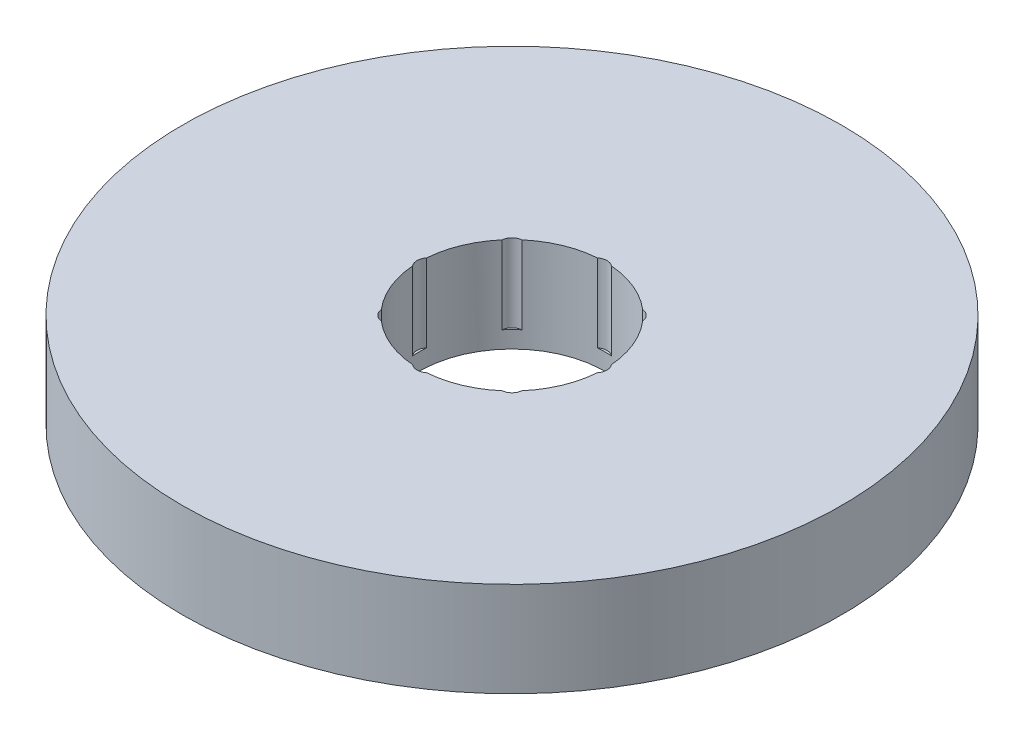
ISO-10303-21;
HEADER;
FILE_DESCRIPTION(('STEP AP214'),'2;1');
FILE_NAME('part.step','',(''),(''),'','','');
FILE_SCHEMA(('AUTOMOTIVE_DESIGN { 1 0 10303 214 1 1 1 1 }'));
ENDSEC;
DATA;
#1=APPLICATION_CONTEXT('core data for automotive mechanical design processes');
#2=APPLICATION_PROTOCOL_DEFINITION('international standard','automotive_design',2000,#1);
#3=PRODUCT_CONTEXT('',#1,'mechanical');
#4=PRODUCT('Part','Part','',(#3));
#5=PRODUCT_RELATED_PRODUCT_CATEGORY('part','',(#4));
#6=PRODUCT_DEFINITION_FORMATION('','',#4);
#7=PRODUCT_DEFINITION_CONTEXT('part definition',#1,'design');
#8=PRODUCT_DEFINITION('design','',#6,#7);
#9=PRODUCT_DEFINITION_SHAPE('','',#8);
#10=(LENGTH_UNIT() NAMED_UNIT(*) SI_UNIT(.MILLI.,.METRE.));
#11=(NAMED_UNIT(*) PLANE_ANGLE_UNIT() SI_UNIT($,.RADIAN.));
#12=(NAMED_UNIT(*) SI_UNIT($,.STERADIAN.) SOLID_ANGLE_UNIT());
#13=UNCERTAINTY_MEASURE_WITH_UNIT(LENGTH_MEASURE(1.E-05),#10,'distance_accuracy_value','');
#14=(GEOMETRIC_REPRESENTATION_CONTEXT(3) GLOBAL_UNCERTAINTY_ASSIGNED_CONTEXT((#13)) GLOBAL_UNIT_ASSIGNED_CONTEXT((#10,
#11,#12)) REPRESENTATION_CONTEXT('',''));
#15=CARTESIAN_POINT('',(0.,0.,0.));
#16=DIRECTION('',(0.,0.,1.));
#17=DIRECTION('',(1.,0.,0.));
#18=AXIS2_PLACEMENT_3D('',#15,#16,#17);
#19=CARTESIAN_POINT('',(0.,23.,0.));
#20=DIRECTION('',(0.,-1.,0.));
#21=DIRECTION('',(0.,0.,-1.));
#22=AXIS2_PLACEMENT_3D('',#19,#20,#21);
#23=CYLINDRICAL_SURFACE('',#22,80.);
#24=CARTESIAN_POINT('',(0.,23.,0.));
#25=DIRECTION('',(0.,1.,0.));
#26=DIRECTION('',(0.,0.,1.));
#27=AXIS2_PLACEMENT_3D('',#24,#25,#26);
#28=CIRCLE('',#27,80.);
#29=CARTESIAN_POINT('',(0.,23.,80.));
#30=VERTEX_POINT('',#29);
#31=EDGE_CURVE('E183',#30,#30,#28,.T.);
#32=ORIENTED_EDGE('',*,*,#31,.F.);
#33=EDGE_LOOP('',(#32));
#34=FACE_BOUND('',#33,.T.);
#35=CARTESIAN_POINT('',(0.,0.,0.));
#36=DIRECTION('',(0.,1.,0.));
#37=DIRECTION('',(0.,0.,1.));
#38=AXIS2_PLACEMENT_3D('',#35,#36,#37);
#39=CIRCLE('',#38,80.);
#40=CARTESIAN_POINT('',(0.,0.,80.));
#41=VERTEX_POINT('',#40);
#42=EDGE_CURVE('E182',#41,#41,#39,.T.);
#43=ORIENTED_EDGE('',*,*,#42,.T.);
#44=EDGE_LOOP('',(#43));
#45=FACE_BOUND('',#44,.T.);
#46=ADVANCED_FACE('F39',(#34,#45),#23,.T.);
#47=CARTESIAN_POINT('',(0.,23.,0.));
#48=DIRECTION('',(0.,1.,0.));
#49=DIRECTION('',(0.,0.,1.));
#50=AXIS2_PLACEMENT_3D('',#47,#48,#49);
#51=PLANE('',#50);
#52=CARTESIAN_POINT('',(0.,23.,20.3535945266166));
#53=DIRECTION('',(0.,1.,0.));
#54=DIRECTION('',(1.,0.,0.));
#55=AXIS2_PLACEMENT_3D('',#52,#53,#54);
#56=CIRCLE('',#55,2.68549616767782);
#57=CARTESIAN_POINT('',(-1.69571030406203,23.,22.43601048682));
#58=VERTEX_POINT('',#57);
#59=CARTESIAN_POINT('',(1.69571030406219,23.,22.43601048682));
#60=VERTEX_POINT('',#59);
#61=EDGE_CURVE('E256',#58,#60,#56,.T.);
#62=ORIENTED_EDGE('',*,*,#61,.F.);
#63=CARTESIAN_POINT('',(0.,23.,0.));
#64=DIRECTION('',(0.,1.,0.));
#65=DIRECTION('',(0.,0.,1.));
#66=AXIS2_PLACEMENT_3D('',#63,#64,#65);
#67=CIRCLE('',#66,22.5);
#68=CARTESIAN_POINT('',(-14.6656069030727,23.,17.0637034129332));
#69=VERTEX_POINT('',#68);
#70=EDGE_CURVE('E175',#69,#58,#67,.T.);
#71=ORIENTED_EDGE('',*,*,#70,.F.);
#72=CARTESIAN_POINT('',(-14.392164711292,23.,14.392164711292));
#73=DIRECTION('',(0.,1.,0.));
#74=DIRECTION('',(0.707106781186549,0.,0.707106781186546));
#75=AXIS2_PLACEMENT_3D('',#72,#73,#74);
#76=CIRCLE('',#75,2.68549616767782);
#77=CARTESIAN_POINT('',(-17.0637034129331,23.,14.6656069030727));
#78=VERTEX_POINT('',#77);
#79=EDGE_CURVE('E152',#78,#69,#76,.T.);
#80=ORIENTED_EDGE('',*,*,#79,.F.);
#81=CARTESIAN_POINT('',(-22.43601048682,23.,1.69571030406211));
#82=VERTEX_POINT('',#81);
#83=EDGE_CURVE('E168',#82,#78,#67,.T.);
#84=ORIENTED_EDGE('',*,*,#83,.F.);
#85=CARTESIAN_POINT('',(-20.3535945266166,23.,0.));
#86=DIRECTION('',(0.,1.,0.));
#87=DIRECTION('',(0.,0.,1.));
#88=AXIS2_PLACEMENT_3D('',#85,#86,#87);
#89=CIRCLE('',#88,2.68549616767782);
#90=CARTESIAN_POINT('',(-22.43601048682,23.,-1.69571030406211));
#91=VERTEX_POINT('',#90);
#92=EDGE_CURVE('E205',#91,#82,#89,.T.);
#93=ORIENTED_EDGE('',*,*,#92,.F.);
#94=CARTESIAN_POINT('',(-17.0637034129333,23.,-14.6656069030725));
#95=VERTEX_POINT('',#94);
#96=EDGE_CURVE('E181',#95,#91,#67,.T.);
#97=ORIENTED_EDGE('',*,*,#96,.F.);
#98=CARTESIAN_POINT('',(-14.3921647112922,23.,-14.3921647112918));
#99=DIRECTION('',(0.,1.,0.));
#100=DIRECTION('',(-0.707106781186539,0.,0.707106781186556));
#101=AXIS2_PLACEMENT_3D('',#98,#99,#100);
#102=CIRCLE('',#101,2.68549616767782);
#103=CARTESIAN_POINT('',(-14.6656069030729,23.,-17.063703412933));
#104=VERTEX_POINT('',#103);
#105=EDGE_CURVE('E453',#104,#95,#102,.T.);
#106=ORIENTED_EDGE('',*,*,#105,.F.);
#107=CARTESIAN_POINT('',(-1.69571030406234,23.,-22.43601048682));
#108=VERTEX_POINT('',#107);
#109=EDGE_CURVE('E189',#108,#104,#67,.T.);
#110=ORIENTED_EDGE('',*,*,#109,.F.);
#111=CARTESIAN_POINT('',(-2.13192586404185E-13,23.,-20.3535945266166));
#112=DIRECTION('',(0.,1.,0.));
#113=DIRECTION('',(-1.,0.,0.));
#114=AXIS2_PLACEMENT_3D('',#111,#112,#113);
#115=CIRCLE('',#114,2.68549616767782);
#116=CARTESIAN_POINT('',(1.69571030406187,23.,-22.43601048682));
#117=VERTEX_POINT('',#116);
#118=EDGE_CURVE('E462',#117,#108,#115,.T.);
#119=ORIENTED_EDGE('',*,*,#118,.F.);
#120=CARTESIAN_POINT('',(14.6656069030726,23.,-17.0637034129333));
#121=VERTEX_POINT('',#120);
#122=EDGE_CURVE('E197',#121,#117,#67,.T.);
#123=ORIENTED_EDGE('',*,*,#122,.F.);
#124=CARTESIAN_POINT('',(14.3921647112919,23.,-14.3921647112921));
#125=DIRECTION('',(0.,1.,0.));
#126=DIRECTION('',(-0.707106781186554,0.,-0.707106781186541));
#127=AXIS2_PLACEMENT_3D('',#124,#125,#126);
#128=CIRCLE('',#127,2.68549616767782);
#129=CARTESIAN_POINT('',(17.063703412933,23.,-14.6656069030729));
#130=VERTEX_POINT('',#129);
#131=EDGE_CURVE('E470',#130,#121,#128,.T.);
#132=ORIENTED_EDGE('',*,*,#131,.F.);
#133=CARTESIAN_POINT('',(22.43601048682,23.,-1.69571030406211));
#134=VERTEX_POINT('',#133);
#135=EDGE_CURVE('E489',#134,#130,#67,.T.);
#136=ORIENTED_EDGE('',*,*,#135,.F.);
#137=CARTESIAN_POINT('',(20.3535945266166,23.,0.));
#138=DIRECTION('',(0.,1.,0.));
#139=DIRECTION('',(0.,0.,-1.));
#140=AXIS2_PLACEMENT_3D('',#137,#138,#139);
#141=CIRCLE('',#140,2.68549616767782);
#142=CARTESIAN_POINT('',(22.43601048682,23.,1.69571030406211));
#143=VERTEX_POINT('',#142);
#144=EDGE_CURVE('E476',#143,#134,#141,.T.);
#145=ORIENTED_EDGE('',*,*,#144,.F.);
#146=CARTESIAN_POINT('',(17.0637034129332,23.,14.6656069030726));
#147=VERTEX_POINT('',#146);
#148=EDGE_CURVE('E491',#147,#143,#67,.T.);
#149=ORIENTED_EDGE('',*,*,#148,.F.);
#150=CARTESIAN_POINT('',(14.3921647112921,23.,14.3921647112919));
#151=DIRECTION('',(0.,1.,0.));
#152=DIRECTION('',(0.707106781186544,0.,-0.707106781186551));
#153=AXIS2_PLACEMENT_3D('',#150,#151,#152);
#154=CIRCLE('',#153,2.68549616767782);
#155=CARTESIAN_POINT('',(14.6656069030728,23.,17.0637034129331));
#156=VERTEX_POINT('',#155);
#157=EDGE_CURVE('E475',#156,#147,#154,.T.);
#158=ORIENTED_EDGE('',*,*,#157,.F.);
#159=EDGE_CURVE('E190',#60,#156,#67,.T.);
#160=ORIENTED_EDGE('',*,*,#159,.F.);
#161=EDGE_LOOP('',(#62,#71,#80,#84,#93,#97,#106,#110,#119,#123,#132,#136,#145,#149,#158,#160));
#162=FACE_BOUND('',#161,.T.);
#163=ORIENTED_EDGE('',*,*,#31,.T.);
#164=EDGE_LOOP('',(#163));
#165=FACE_BOUND('',#164,.T.);
#166=ADVANCED_FACE('F170',(#162,#165),#51,.T.);
#167=CARTESIAN_POINT('',(0.,0.,0.));
#168=DIRECTION('',(0.,1.,0.));
#169=DIRECTION('',(0.,0.,1.));
#170=AXIS2_PLACEMENT_3D('',#167,#168,#169);
#171=PLANE('',#170);
#172=CARTESIAN_POINT('',(0.,0.,0.));
#173=DIRECTION('',(0.,1.,0.));
#174=DIRECTION('',(0.,0.,1.));
#175=AXIS2_PLACEMENT_3D('',#172,#173,#174);
#176=CIRCLE('',#175,22.5);
#177=CARTESIAN_POINT('',(0.,0.,22.5));
#178=VERTEX_POINT('',#177);
#179=EDGE_CURVE('E191',#178,#178,#176,.T.);
#180=ORIENTED_EDGE('',*,*,#179,.T.);
#181=EDGE_LOOP('',(#180));
#182=FACE_BOUND('',#181,.T.);
#183=ORIENTED_EDGE('',*,*,#42,.F.);
#184=EDGE_LOOP('',(#183));
#185=FACE_BOUND('',#184,.T.);
#186=ADVANCED_FACE('F277',(#182,#185),#171,.F.);
#187=CARTESIAN_POINT('',(0.,23.,0.));
#188=DIRECTION('',(0.,-1.,0.));
#189=DIRECTION('',(0.,0.,-1.));
#190=AXIS2_PLACEMENT_3D('',#187,#188,#189);
#191=CYLINDRICAL_SURFACE('',#190,22.5);
#192=DIRECTION('',(0.,1.,0.));
#193=VECTOR('',#192,1.);
#194=CARTESIAN_POINT('',(-1.69571030406204,13.5446973686597,22.43601048682));
#195=LINE('',#194,#193);
#196=CARTESIAN_POINT('',(-1.69571030406203,4.08939473731939,22.43601048682));
#197=VERTEX_POINT('',#196);
#198=EDGE_CURVE('E11',#197,#58,#195,.T.);
#199=ORIENTED_EDGE('',*,*,#198,.F.);
#200=CARTESIAN_POINT('',(0.,4.08939473731939,0.));
#201=DIRECTION('',(0.,1.,0.));
#202=DIRECTION('',(0.,0.,1.));
#203=AXIS2_PLACEMENT_3D('',#200,#201,#202);
#204=CIRCLE('',#203,22.5);
#205=CARTESIAN_POINT('',(1.69571030406219,4.08939473731939,22.43601048682));
#206=VERTEX_POINT('',#205);
#207=EDGE_CURVE('E251',#197,#206,#204,.T.);
#208=ORIENTED_EDGE('',*,*,#207,.T.);
#209=DIRECTION('',(0.,1.,0.));
#210=VECTOR('',#209,1.);
#211=CARTESIAN_POINT('',(1.6957103040622,13.5446973686597,22.43601048682));
#212=LINE('',#211,#210);
#213=EDGE_CURVE('E46',#60,#206,#212,.F.);
#214=ORIENTED_EDGE('',*,*,#213,.F.);
#215=ORIENTED_EDGE('',*,*,#159,.T.);
#216=DIRECTION('',(0.,1.,0.));
#217=VECTOR('',#216,1.);
#218=CARTESIAN_POINT('',(14.6656069030728,13.5446973686597,17.0637034129331));
#219=LINE('',#218,#217);
#220=CARTESIAN_POINT('',(14.6656069030728,4.08939473731939,17.0637034129331));
#221=VERTEX_POINT('',#220);
#222=EDGE_CURVE('E253',#221,#156,#219,.T.);
#223=ORIENTED_EDGE('',*,*,#222,.F.);
#224=CARTESIAN_POINT('',(0.,4.08939473731939,0.));
#225=DIRECTION('',(0.,1.,0.));
#226=DIRECTION('',(0.,0.,1.));
#227=AXIS2_PLACEMENT_3D('',#224,#225,#226);
#228=CIRCLE('',#227,22.5);
#229=CARTESIAN_POINT('',(17.0637034129332,4.08939473731939,14.6656069030726));
#230=VERTEX_POINT('',#229);
#231=EDGE_CURVE('E246',#221,#230,#228,.T.);
#232=ORIENTED_EDGE('',*,*,#231,.T.);
#233=DIRECTION('',(0.,1.,0.));
#234=VECTOR('',#233,1.);
#235=CARTESIAN_POINT('',(17.0637034129332,13.5446973686597,14.6656069030726));
#236=LINE('',#235,#234);
#237=EDGE_CURVE('E248',#147,#230,#236,.F.);
#238=ORIENTED_EDGE('',*,*,#237,.F.);
#239=ORIENTED_EDGE('',*,*,#148,.T.);
#240=DIRECTION('',(0.,1.,0.));
#241=VECTOR('',#240,1.);
#242=CARTESIAN_POINT('',(22.43601048682,13.5446973686597,1.69571030406212));
#243=LINE('',#242,#241);
#244=CARTESIAN_POINT('',(22.43601048682,4.08939473731939,1.69571030406211));
#245=VERTEX_POINT('',#244);
#246=EDGE_CURVE('E243',#245,#143,#243,.T.);
#247=ORIENTED_EDGE('',*,*,#246,.F.);
#248=CARTESIAN_POINT('',(0.,4.08939473731939,0.));
#249=DIRECTION('',(0.,1.,0.));
#250=DIRECTION('',(0.,0.,1.));
#251=AXIS2_PLACEMENT_3D('',#248,#249,#250);
#252=CIRCLE('',#251,22.5);
#253=CARTESIAN_POINT('',(22.43601048682,4.08939473731939,-1.69571030406211));
#254=VERTEX_POINT('',#253);
#255=EDGE_CURVE('E236',#245,#254,#252,.T.);
#256=ORIENTED_EDGE('',*,*,#255,.T.);
#257=DIRECTION('',(0.,1.,0.));
#258=VECTOR('',#257,1.);
#259=CARTESIAN_POINT('',(22.43601048682,13.5446973686597,-1.69571030406212));
#260=LINE('',#259,#258);
#261=EDGE_CURVE('E241',#134,#254,#260,.F.);
#262=ORIENTED_EDGE('',*,*,#261,.F.);
#263=ORIENTED_EDGE('',*,*,#135,.T.);
#264=DIRECTION('',(0.,1.,0.));
#265=VECTOR('',#264,1.);
#266=CARTESIAN_POINT('',(17.063703412933,13.5446973686597,-14.6656069030728));
#267=LINE('',#266,#265);
#268=CARTESIAN_POINT('',(17.063703412933,4.08939473731939,-14.6656069030729));
#269=VERTEX_POINT('',#268);
#270=EDGE_CURVE('E237',#269,#130,#267,.T.);
#271=ORIENTED_EDGE('',*,*,#270,.F.);
#272=CARTESIAN_POINT('',(0.,4.08939473731939,0.));
#273=DIRECTION('',(0.,1.,0.));
#274=DIRECTION('',(0.,0.,1.));
#275=AXIS2_PLACEMENT_3D('',#272,#273,#274);
#276=CIRCLE('',#275,22.5);
#277=CARTESIAN_POINT('',(14.6656069030726,4.08939473731939,-17.0637034129333));
#278=VERTEX_POINT('',#277);
#279=EDGE_CURVE('E229',#269,#278,#276,.T.);
#280=ORIENTED_EDGE('',*,*,#279,.T.);
#281=DIRECTION('',(0.,1.,0.));
#282=VECTOR('',#281,1.);
#283=CARTESIAN_POINT('',(14.6656069030725,13.5446973686597,-17.0637034129333));
#284=LINE('',#283,#282);
#285=EDGE_CURVE('E232',#121,#278,#284,.F.);
#286=ORIENTED_EDGE('',*,*,#285,.F.);
#287=ORIENTED_EDGE('',*,*,#122,.T.);
#288=DIRECTION('',(0.,1.,0.));
#289=VECTOR('',#288,1.);
#290=CARTESIAN_POINT('',(1.69571030406188,13.5446973686597,-22.43601048682));
#291=LINE('',#290,#289);
#292=CARTESIAN_POINT('',(1.69571030406187,4.08939473731939,-22.43601048682));
#293=VERTEX_POINT('',#292);
#294=EDGE_CURVE('E227',#293,#117,#291,.T.);
#295=ORIENTED_EDGE('',*,*,#294,.F.);
#296=CARTESIAN_POINT('',(0.,4.08939473731939,0.));
#297=DIRECTION('',(0.,1.,0.));
#298=DIRECTION('',(0.,0.,1.));
#299=AXIS2_PLACEMENT_3D('',#296,#297,#298);
#300=CIRCLE('',#299,22.5);
#301=CARTESIAN_POINT('',(-1.69571030406234,4.08939473731939,-22.43601048682));
#302=VERTEX_POINT('',#301);
#303=EDGE_CURVE('E225',#293,#302,#300,.T.);
#304=ORIENTED_EDGE('',*,*,#303,.T.);
#305=DIRECTION('',(0.,1.,0.));
#306=VECTOR('',#305,1.);
#307=CARTESIAN_POINT('',(-1.69571030406235,13.5446973686597,-22.43601048682));
#308=LINE('',#307,#306);
#309=EDGE_CURVE('E223',#108,#302,#308,.F.);
#310=ORIENTED_EDGE('',*,*,#309,.F.);
#311=ORIENTED_EDGE('',*,*,#109,.T.);
#312=DIRECTION('',(0.,1.,0.));
#313=VECTOR('',#312,1.);
#314=CARTESIAN_POINT('',(-14.6656069030729,13.5446973686597,-17.063703412933));
#315=LINE('',#314,#313);
#316=CARTESIAN_POINT('',(-14.6656069030729,4.08939473731939,-17.063703412933));
#317=VERTEX_POINT('',#316);
#318=EDGE_CURVE('E219',#317,#104,#315,.T.);
#319=ORIENTED_EDGE('',*,*,#318,.F.);
#320=CARTESIAN_POINT('',(0.,4.08939473731939,0.));
#321=DIRECTION('',(0.,1.,0.));
#322=DIRECTION('',(0.,0.,1.));
#323=AXIS2_PLACEMENT_3D('',#320,#321,#322);
#324=CIRCLE('',#323,22.5);
#325=CARTESIAN_POINT('',(-17.0637034129333,4.08939473731939,-14.6656069030725));
#326=VERTEX_POINT('',#325);
#327=EDGE_CURVE('E159',#317,#326,#324,.T.);
#328=ORIENTED_EDGE('',*,*,#327,.T.);
#329=DIRECTION('',(0.,1.,0.));
#330=VECTOR('',#329,1.);
#331=CARTESIAN_POINT('',(-17.0637034129333,13.5446973686597,-14.6656069030725));
#332=LINE('',#331,#330);
#333=EDGE_CURVE('E220',#95,#326,#332,.F.);
#334=ORIENTED_EDGE('',*,*,#333,.F.);
#335=ORIENTED_EDGE('',*,*,#96,.T.);
#336=DIRECTION('',(0.,1.,0.));
#337=VECTOR('',#336,1.);
#338=CARTESIAN_POINT('',(-22.43601048682,13.5446973686597,-1.69571030406212));
#339=LINE('',#338,#337);
#340=CARTESIAN_POINT('',(-22.43601048682,4.08939473731939,-1.69571030406211));
#341=VERTEX_POINT('',#340);
#342=EDGE_CURVE('E209',#341,#91,#339,.T.);
#343=ORIENTED_EDGE('',*,*,#342,.F.);
#344=CARTESIAN_POINT('',(0.,4.08939473731939,0.));
#345=DIRECTION('',(0.,1.,0.));
#346=DIRECTION('',(0.,0.,1.));
#347=AXIS2_PLACEMENT_3D('',#344,#345,#346);
#348=CIRCLE('',#347,22.5);
#349=CARTESIAN_POINT('',(-22.43601048682,4.08939473731939,1.69571030406211));
#350=VERTEX_POINT('',#349);
#351=EDGE_CURVE('E206',#341,#350,#348,.T.);
#352=ORIENTED_EDGE('',*,*,#351,.T.);
#353=DIRECTION('',(0.,1.,0.));
#354=VECTOR('',#353,1.);
#355=CARTESIAN_POINT('',(-22.43601048682,13.5446973686597,1.69571030406212));
#356=LINE('',#355,#354);
#357=EDGE_CURVE('E179',#82,#350,#356,.F.);
#358=ORIENTED_EDGE('',*,*,#357,.F.);
#359=ORIENTED_EDGE('',*,*,#83,.T.);
#360=DIRECTION('',(0.,1.,0.));
#361=VECTOR('',#360,1.);
#362=CARTESIAN_POINT('',(-17.0637034129331,13.5446973686597,14.6656069030727));
#363=LINE('',#362,#361);
#364=CARTESIAN_POINT('',(-17.0637034129331,4.08939473731939,14.6656069030727));
#365=VERTEX_POINT('',#364);
#366=EDGE_CURVE('E147',#365,#78,#363,.T.);
#367=ORIENTED_EDGE('',*,*,#366,.F.);
#368=CARTESIAN_POINT('',(0.,4.08939473731939,0.));
#369=DIRECTION('',(0.,1.,0.));
#370=DIRECTION('',(0.,0.,1.));
#371=AXIS2_PLACEMENT_3D('',#368,#369,#370);
#372=CIRCLE('',#371,22.5);
#373=CARTESIAN_POINT('',(-14.6656069030727,4.08939473731939,17.0637034129332));
#374=VERTEX_POINT('',#373);
#375=EDGE_CURVE('E215',#365,#374,#372,.T.);
#376=ORIENTED_EDGE('',*,*,#375,.T.);
#377=DIRECTION('',(0.,1.,0.));
#378=VECTOR('',#377,1.);
#379=CARTESIAN_POINT('',(-14.6656069030727,13.5446973686597,17.0637034129332));
#380=LINE('',#379,#378);
#381=EDGE_CURVE('E161',#69,#374,#380,.F.);
#382=ORIENTED_EDGE('',*,*,#381,.F.);
#383=ORIENTED_EDGE('',*,*,#70,.T.);
#384=EDGE_LOOP('',(#199,#208,#214,#215,#223,#232,#238,#239,#247,#256,#262,#263,#271,#280,#286,
#287,#295,#304,#310,#311,#319,#328,#334,#335,#343,#352,#358,#359,#367,#376,#382,#383));
#385=FACE_BOUND('',#384,.T.);
#386=ORIENTED_EDGE('',*,*,#179,.F.);
#387=EDGE_LOOP('',(#386));
#388=FACE_BOUND('',#387,.T.);
#389=ADVANCED_FACE('F176',(#385,#388),#191,.F.);
#390=CARTESIAN_POINT('',(-20.3535945266166,4.08939473731939,0.));
#391=DIRECTION('',(0.,1.,0.));
#392=DIRECTION('',(0.,0.,1.));
#393=AXIS2_PLACEMENT_3D('',#390,#391,#392);
#394=CYLINDRICAL_SURFACE('',#393,2.68549616767782);
#395=ORIENTED_EDGE('',*,*,#342,.T.);
#396=ORIENTED_EDGE('',*,*,#92,.T.);
#397=ORIENTED_EDGE('',*,*,#357,.T.);
#398=CARTESIAN_POINT('',(-20.3535945266166,4.08939473731939,0.));
#399=DIRECTION('',(0.,1.,0.));
#400=DIRECTION('',(0.,0.,1.));
#401=AXIS2_PLACEMENT_3D('',#398,#399,#400);
#402=CIRCLE('',#401,2.68549616767782);
#403=EDGE_CURVE('E200',#341,#350,#402,.T.);
#404=ORIENTED_EDGE('',*,*,#403,.F.);
#405=EDGE_LOOP('',(#395,#396,#397,#404));
#406=FACE_BOUND('',#405,.T.);
#407=ADVANCED_FACE('F286',(#406),#394,.F.);
#408=CARTESIAN_POINT('',(-20.3535945266166,4.08939473731939,0.));
#409=DIRECTION('',(0.,1.,0.));
#410=DIRECTION('',(0.,0.,1.));
#411=AXIS2_PLACEMENT_3D('',#408,#409,#410);
#412=PLANE('',#411);
#413=ORIENTED_EDGE('',*,*,#403,.T.);
#414=ORIENTED_EDGE('',*,*,#351,.F.);
#415=EDGE_LOOP('',(#413,#414));
#416=FACE_BOUND('',#415,.T.);
#417=ADVANCED_FACE('F289',(#416),#412,.T.);
#418=CARTESIAN_POINT('',(-14.392164711292,4.08939473731939,14.392164711292));
#419=DIRECTION('',(0.,1.,0.));
#420=DIRECTION('',(0.,0.,1.));
#421=AXIS2_PLACEMENT_3D('',#418,#419,#420);
#422=CYLINDRICAL_SURFACE('',#421,2.68549616767782);
#423=ORIENTED_EDGE('',*,*,#366,.T.);
#424=ORIENTED_EDGE('',*,*,#79,.T.);
#425=ORIENTED_EDGE('',*,*,#381,.T.);
#426=CARTESIAN_POINT('',(-14.392164711292,4.08939473731939,14.392164711292));
#427=DIRECTION('',(0.,1.,0.));
#428=DIRECTION('',(0.707106781186549,0.,0.707106781186546));
#429=AXIS2_PLACEMENT_3D('',#426,#427,#428);
#430=CIRCLE('',#429,2.68549616767782);
#431=EDGE_CURVE('E156',#365,#374,#430,.T.);
#432=ORIENTED_EDGE('',*,*,#431,.F.);
#433=EDGE_LOOP('',(#423,#424,#425,#432));
#434=FACE_BOUND('',#433,.T.);
#435=ADVANCED_FACE('F155',(#434),#422,.F.);
#436=CARTESIAN_POINT('',(-14.392164711292,4.08939473731939,14.392164711292));
#437=DIRECTION('',(0.,1.,0.));
#438=DIRECTION('',(0.707106781186549,0.,0.707106781186546));
#439=AXIS2_PLACEMENT_3D('',#436,#437,#438);
#440=PLANE('',#439);
#441=ORIENTED_EDGE('',*,*,#431,.T.);
#442=ORIENTED_EDGE('',*,*,#375,.F.);
#443=EDGE_LOOP('',(#441,#442));
#444=FACE_BOUND('',#443,.T.);
#445=ADVANCED_FACE('F300',(#444),#440,.T.);
#446=CARTESIAN_POINT('',(-14.3921647112922,4.08939473731939,-14.3921647112918));
#447=DIRECTION('',(0.,1.,0.));
#448=DIRECTION('',(0.,0.,1.));
#449=AXIS2_PLACEMENT_3D('',#446,#447,#448);
#450=CYLINDRICAL_SURFACE('',#449,2.68549616767782);
#451=ORIENTED_EDGE('',*,*,#318,.T.);
#452=ORIENTED_EDGE('',*,*,#105,.T.);
#453=ORIENTED_EDGE('',*,*,#333,.T.);
#454=CARTESIAN_POINT('',(-14.3921647112922,4.08939473731939,-14.3921647112918));
#455=DIRECTION('',(0.,1.,0.));
#456=DIRECTION('',(-0.707106781186539,0.,0.707106781186556));
#457=AXIS2_PLACEMENT_3D('',#454,#455,#456);
#458=CIRCLE('',#457,2.68549616767782);
#459=EDGE_CURVE('E454',#317,#326,#458,.T.);
#460=ORIENTED_EDGE('',*,*,#459,.F.);
#461=EDGE_LOOP('',(#451,#452,#453,#460));
#462=FACE_BOUND('',#461,.T.);
#463=ADVANCED_FACE('F299',(#462),#450,.F.);
#464=CARTESIAN_POINT('',(-14.3921647112922,4.08939473731939,-14.3921647112918));
#465=DIRECTION('',(0.,1.,0.));
#466=DIRECTION('',(-0.707106781186539,0.,0.707106781186556));
#467=AXIS2_PLACEMENT_3D('',#464,#465,#466);
#468=PLANE('',#467);
#469=ORIENTED_EDGE('',*,*,#459,.T.);
#470=ORIENTED_EDGE('',*,*,#327,.F.);
#471=EDGE_LOOP('',(#469,#470));
#472=FACE_BOUND('',#471,.T.);
#473=ADVANCED_FACE('F379',(#472),#468,.T.);
#474=CARTESIAN_POINT('',(-2.13192586404185E-13,4.08939473731939,-20.3535945266166));
#475=DIRECTION('',(0.,1.,0.));
#476=DIRECTION('',(0.,0.,1.));
#477=AXIS2_PLACEMENT_3D('',#474,#475,#476);
#478=CYLINDRICAL_SURFACE('',#477,2.68549616767782);
#479=ORIENTED_EDGE('',*,*,#294,.T.);
#480=ORIENTED_EDGE('',*,*,#118,.T.);
#481=ORIENTED_EDGE('',*,*,#309,.T.);
#482=CARTESIAN_POINT('',(-2.13192586404185E-13,4.08939473731939,-20.3535945266166));
#483=DIRECTION('',(0.,1.,0.));
#484=DIRECTION('',(-1.,0.,0.));
#485=AXIS2_PLACEMENT_3D('',#482,#483,#484);
#486=CIRCLE('',#485,2.68549616767782);
#487=EDGE_CURVE('E465',#293,#302,#486,.T.);
#488=ORIENTED_EDGE('',*,*,#487,.F.);
#489=EDGE_LOOP('',(#479,#480,#481,#488));
#490=FACE_BOUND('',#489,.T.);
#491=ADVANCED_FACE('F371',(#490),#478,.F.);
#492=CARTESIAN_POINT('',(-2.13192586404185E-13,4.08939473731939,-20.3535945266166));
#493=DIRECTION('',(0.,1.,0.));
#494=DIRECTION('',(-1.,0.,0.));
#495=AXIS2_PLACEMENT_3D('',#492,#493,#494);
#496=PLANE('',#495);
#497=ORIENTED_EDGE('',*,*,#487,.T.);
#498=ORIENTED_EDGE('',*,*,#303,.F.);
#499=EDGE_LOOP('',(#497,#498));
#500=FACE_BOUND('',#499,.T.);
#501=ADVANCED_FACE('F308',(#500),#496,.T.);
#502=CARTESIAN_POINT('',(14.3921647112919,4.08939473731939,-14.3921647112921));
#503=DIRECTION('',(0.,1.,0.));
#504=DIRECTION('',(0.,0.,1.));
#505=AXIS2_PLACEMENT_3D('',#502,#503,#504);
#506=CYLINDRICAL_SURFACE('',#505,2.68549616767782);
#507=ORIENTED_EDGE('',*,*,#270,.T.);
#508=ORIENTED_EDGE('',*,*,#131,.T.);
#509=ORIENTED_EDGE('',*,*,#285,.T.);
#510=CARTESIAN_POINT('',(14.3921647112919,4.08939473731939,-14.3921647112921));
#511=DIRECTION('',(0.,1.,0.));
#512=DIRECTION('',(-0.707106781186554,0.,-0.707106781186541));
#513=AXIS2_PLACEMENT_3D('',#510,#511,#512);
#514=CIRCLE('',#513,2.68549616767782);
#515=EDGE_CURVE('E477',#269,#278,#514,.T.);
#516=ORIENTED_EDGE('',*,*,#515,.F.);
#517=EDGE_LOOP('',(#507,#508,#509,#516));
#518=FACE_BOUND('',#517,.T.);
#519=ADVANCED_FACE('F305',(#518),#506,.F.);
#520=CARTESIAN_POINT('',(14.3921647112919,4.08939473731939,-14.3921647112921));
#521=DIRECTION('',(0.,1.,0.));
#522=DIRECTION('',(-0.707106781186554,0.,-0.707106781186541));
#523=AXIS2_PLACEMENT_3D('',#520,#521,#522);
#524=PLANE('',#523);
#525=ORIENTED_EDGE('',*,*,#515,.T.);
#526=ORIENTED_EDGE('',*,*,#279,.F.);
#527=EDGE_LOOP('',(#525,#526));
#528=FACE_BOUND('',#527,.T.);
#529=ADVANCED_FACE('F304',(#528),#524,.T.);
#530=CARTESIAN_POINT('',(20.3535945266166,4.08939473731939,0.));
#531=DIRECTION('',(0.,1.,0.));
#532=DIRECTION('',(0.,0.,1.));
#533=AXIS2_PLACEMENT_3D('',#530,#531,#532);
#534=CYLINDRICAL_SURFACE('',#533,2.68549616767782);
#535=ORIENTED_EDGE('',*,*,#246,.T.);
#536=ORIENTED_EDGE('',*,*,#144,.T.);
#537=ORIENTED_EDGE('',*,*,#261,.T.);
#538=CARTESIAN_POINT('',(20.3535945266166,4.08939473731939,0.));
#539=DIRECTION('',(0.,1.,0.));
#540=DIRECTION('',(0.,0.,-1.));
#541=AXIS2_PLACEMENT_3D('',#538,#539,#540);
#542=CIRCLE('',#541,2.68549616767782);
#543=EDGE_CURVE('E478',#245,#254,#542,.T.);
#544=ORIENTED_EDGE('',*,*,#543,.F.);
#545=EDGE_LOOP('',(#535,#536,#537,#544));
#546=FACE_BOUND('',#545,.T.);
#547=ADVANCED_FACE('F309',(#546),#534,.F.);
#548=CARTESIAN_POINT('',(20.3535945266166,4.08939473731939,0.));
#549=DIRECTION('',(0.,1.,0.));
#550=DIRECTION('',(0.,0.,-1.));
#551=AXIS2_PLACEMENT_3D('',#548,#549,#550);
#552=PLANE('',#551);
#553=ORIENTED_EDGE('',*,*,#543,.T.);
#554=ORIENTED_EDGE('',*,*,#255,.F.);
#555=EDGE_LOOP('',(#553,#554));
#556=FACE_BOUND('',#555,.T.);
#557=ADVANCED_FACE('F314',(#556),#552,.T.);
#558=CARTESIAN_POINT('',(14.3921647112921,4.08939473731939,14.3921647112919));
#559=DIRECTION('',(0.,1.,0.));
#560=DIRECTION('',(0.,0.,1.));
#561=AXIS2_PLACEMENT_3D('',#558,#559,#560);
#562=CYLINDRICAL_SURFACE('',#561,2.68549616767782);
#563=ORIENTED_EDGE('',*,*,#222,.T.);
#564=ORIENTED_EDGE('',*,*,#157,.T.);
#565=ORIENTED_EDGE('',*,*,#237,.T.);
#566=CARTESIAN_POINT('',(14.3921647112921,4.08939473731939,14.3921647112919));
#567=DIRECTION('',(0.,1.,0.));
#568=DIRECTION('',(0.707106781186544,0.,-0.707106781186551));
#569=AXIS2_PLACEMENT_3D('',#566,#567,#568);
#570=CIRCLE('',#569,2.68549616767782);
#571=EDGE_CURVE('E56',#221,#230,#570,.T.);
#572=ORIENTED_EDGE('',*,*,#571,.F.);
#573=EDGE_LOOP('',(#563,#564,#565,#572));
#574=FACE_BOUND('',#573,.T.);
#575=ADVANCED_FACE('F318',(#574),#562,.F.);
#576=CARTESIAN_POINT('',(14.3921647112921,4.08939473731939,14.3921647112919));
#577=DIRECTION('',(0.,1.,0.));
#578=DIRECTION('',(0.707106781186544,0.,-0.707106781186551));
#579=AXIS2_PLACEMENT_3D('',#576,#577,#578);
#580=PLANE('',#579);
#581=ORIENTED_EDGE('',*,*,#571,.T.);
#582=ORIENTED_EDGE('',*,*,#231,.F.);
#583=EDGE_LOOP('',(#581,#582));
#584=FACE_BOUND('',#583,.T.);
#585=ADVANCED_FACE('F270',(#584),#580,.T.);
#586=CARTESIAN_POINT('',(0.,4.08939473731939,20.3535945266166));
#587=DIRECTION('',(0.,1.,0.));
#588=DIRECTION('',(0.,0.,1.));
#589=AXIS2_PLACEMENT_3D('',#586,#587,#588);
#590=CYLINDRICAL_SURFACE('',#589,2.68549616767782);
#591=ORIENTED_EDGE('',*,*,#198,.T.);
#592=ORIENTED_EDGE('',*,*,#61,.T.);
#593=ORIENTED_EDGE('',*,*,#213,.T.);
#594=CARTESIAN_POINT('',(0.,4.08939473731939,20.3535945266166));
#595=DIRECTION('',(0.,1.,0.));
#596=DIRECTION('',(1.,0.,0.));
#597=AXIS2_PLACEMENT_3D('',#594,#595,#596);
#598=CIRCLE('',#597,2.68549616767782);
#599=EDGE_CURVE('E55',#197,#206,#598,.T.);
#600=ORIENTED_EDGE('',*,*,#599,.F.);
#601=EDGE_LOOP('',(#591,#592,#593,#600));
#602=FACE_BOUND('',#601,.T.);
#603=ADVANCED_FACE('F260',(#602),#590,.F.);
#604=CARTESIAN_POINT('',(0.,4.08939473731939,20.3535945266166));
#605=DIRECTION('',(0.,1.,0.));
#606=DIRECTION('',(1.,0.,0.));
#607=AXIS2_PLACEMENT_3D('',#604,#605,#606);
#608=PLANE('',#607);
#609=ORIENTED_EDGE('',*,*,#599,.T.);
#610=ORIENTED_EDGE('',*,*,#207,.F.);
#611=EDGE_LOOP('',(#609,#610));
#612=FACE_BOUND('',#611,.T.);
#613=ADVANCED_FACE('F261',(#612),#608,.T.);
#614=CLOSED_SHELL('',(#46,#166,#186,#389,#407,#417,#435,#445,#463,#473,#491,#501,#519,#529,#547,
#557,#575,#585,#603,#613));
#615=MANIFOLD_SOLID_BREP('B2',#614);
#616=ADVANCED_BREP_SHAPE_REPRESENTATION('',(#18,#615),#14);
#617=SHAPE_DEFINITION_REPRESENTATION(#9,#616);
ENDSEC;
END-ISO-10303-21;
